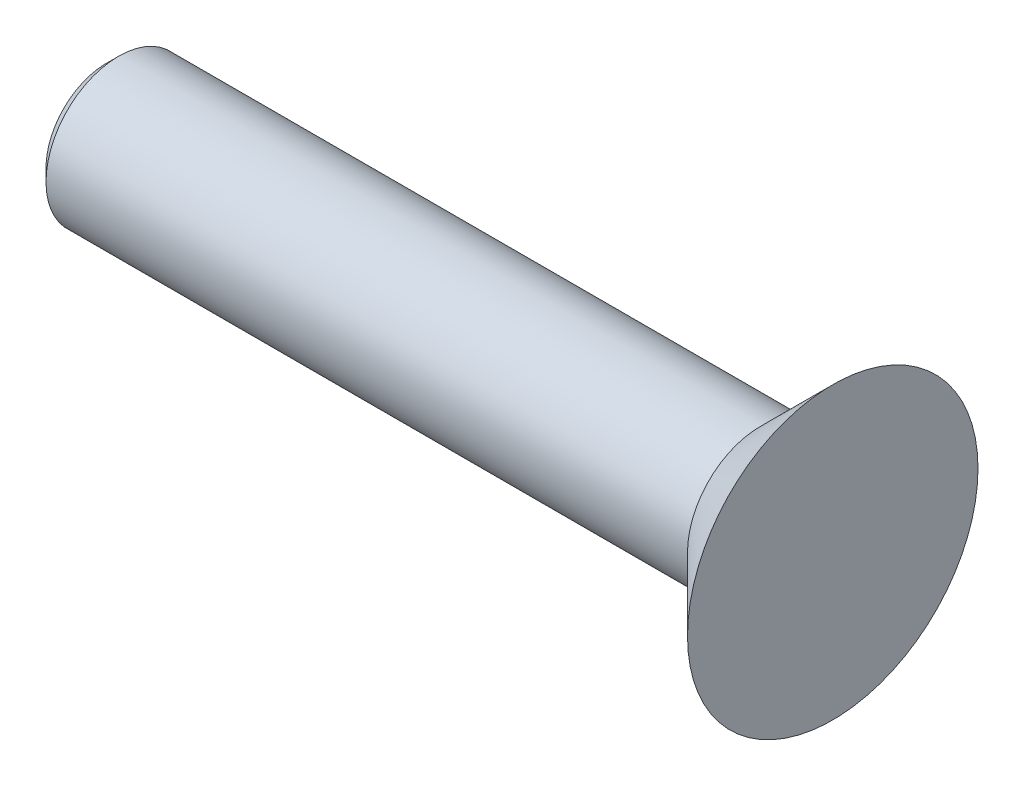
ISO-10303-21;
HEADER;
FILE_DESCRIPTION(('STEP AP214'),'2;1');
FILE_NAME('part.step','',(''),(''),'','','');
FILE_SCHEMA(('AUTOMOTIVE_DESIGN { 1 0 10303 214 1 1 1 1 }'));
ENDSEC;
DATA;
#1=APPLICATION_CONTEXT('core data for automotive mechanical design processes');
#2=APPLICATION_PROTOCOL_DEFINITION('international standard','automotive_design',2000,#1);
#3=PRODUCT_CONTEXT('',#1,'mechanical');
#4=PRODUCT('Part','Part','',(#3));
#5=PRODUCT_RELATED_PRODUCT_CATEGORY('part','',(#4));
#6=PRODUCT_DEFINITION_FORMATION('','',#4);
#7=PRODUCT_DEFINITION_CONTEXT('part definition',#1,'design');
#8=PRODUCT_DEFINITION('design','',#6,#7);
#9=PRODUCT_DEFINITION_SHAPE('','',#8);
#10=(LENGTH_UNIT() NAMED_UNIT(*) SI_UNIT(.MILLI.,.METRE.));
#11=(NAMED_UNIT(*) PLANE_ANGLE_UNIT() SI_UNIT($,.RADIAN.));
#12=(NAMED_UNIT(*) SI_UNIT($,.STERADIAN.) SOLID_ANGLE_UNIT());
#13=UNCERTAINTY_MEASURE_WITH_UNIT(LENGTH_MEASURE(1.E-05),#10,'distance_accuracy_value','');
#14=(GEOMETRIC_REPRESENTATION_CONTEXT(3) GLOBAL_UNCERTAINTY_ASSIGNED_CONTEXT((#13)) GLOBAL_UNIT_ASSIGNED_CONTEXT((#10,
#11,#12)) REPRESENTATION_CONTEXT('',''));
#15=CARTESIAN_POINT('',(0.,0.,0.));
#16=DIRECTION('',(0.,0.,1.));
#17=DIRECTION('',(1.,0.,0.));
#18=AXIS2_PLACEMENT_3D('',#15,#16,#17);
#19=CARTESIAN_POINT('',(0.,2.99999999999998,0.));
#20=DIRECTION('',(-1.,0.,0.));
#21=DIRECTION('',(0.,0.,1.));
#22=AXIS2_PLACEMENT_3D('',#19,#20,#21);
#23=PLANE('',#22);
#24=CARTESIAN_POINT('',(0.,0.,0.));
#25=DIRECTION('',(-1.,0.,0.));
#26=DIRECTION('',(0.,0.,1.));
#27=AXIS2_PLACEMENT_3D('',#24,#25,#26);
#28=CIRCLE('',#27,2.99999999999998);
#29=CARTESIAN_POINT('',(0.,0.,2.99999999999998));
#30=VERTEX_POINT('',#29);
#31=EDGE_CURVE('E34',#30,#30,#28,.T.);
#32=ORIENTED_EDGE('',*,*,#31,.F.);
#33=EDGE_LOOP('',(#32));
#34=FACE_BOUND('',#33,.T.);
#35=ADVANCED_FACE('F24',(#34),#23,.F.);
#36=CARTESIAN_POINT('',(0.,0.,0.));
#37=DIRECTION('',(1.,0.,0.));
#38=DIRECTION('',(0.,0.,-1.));
#39=AXIS2_PLACEMENT_3D('',#36,#37,#38);
#40=CONICAL_SURFACE('',#39,2.99999999999998,0.785398163397443);
#41=CARTESIAN_POINT('',(-1.5,0.,0.));
#42=DIRECTION('',(-1.,0.,0.));
#43=DIRECTION('',(0.,0.,1.));
#44=AXIS2_PLACEMENT_3D('',#41,#42,#43);
#45=CIRCLE('',#44,1.5);
#46=CARTESIAN_POINT('',(-1.5,0.,1.5));
#47=VERTEX_POINT('',#46);
#48=EDGE_CURVE('E38',#47,#47,#45,.T.);
#49=ORIENTED_EDGE('',*,*,#48,.F.);
#50=EDGE_LOOP('',(#49));
#51=FACE_BOUND('',#50,.T.);
#52=ORIENTED_EDGE('',*,*,#31,.T.);
#53=EDGE_LOOP('',(#52));
#54=FACE_BOUND('',#53,.T.);
#55=ADVANCED_FACE('F46',(#51,#54),#40,.T.);
#56=CARTESIAN_POINT('',(0.,0.,0.));
#57=DIRECTION('',(-1.,0.,0.));
#58=DIRECTION('',(0.,0.,1.));
#59=AXIS2_PLACEMENT_3D('',#56,#57,#58);
#60=CYLINDRICAL_SURFACE('',#59,1.5);
#61=CARTESIAN_POINT('',(-14.75,0.,0.));
#62=DIRECTION('',(1.,0.,0.));
#63=DIRECTION('',(0.,0.,-1.));
#64=AXIS2_PLACEMENT_3D('',#61,#62,#63);
#65=CIRCLE('',#64,1.5);
#66=CARTESIAN_POINT('',(-14.75,0.,-1.5));
#67=VERTEX_POINT('',#66);
#68=EDGE_CURVE('E10',#67,#67,#65,.T.);
#69=ORIENTED_EDGE('',*,*,#68,.T.);
#70=EDGE_LOOP('',(#69));
#71=FACE_BOUND('',#70,.T.);
#72=ORIENTED_EDGE('',*,*,#48,.T.);
#73=EDGE_LOOP('',(#72));
#74=FACE_BOUND('',#73,.T.);
#75=ADVANCED_FACE('F44',(#71,#74),#60,.T.);
#76=CARTESIAN_POINT('',(-15.,0.,0.));
#77=DIRECTION('',(1.,0.,0.));
#78=DIRECTION('',(0.,0.,-1.));
#79=AXIS2_PLACEMENT_3D('',#76,#77,#78);
#80=PLANE('',#79);
#81=CARTESIAN_POINT('',(-15.,0.,0.));
#82=DIRECTION('',(1.,0.,0.));
#83=DIRECTION('',(0.,0.,-1.));
#84=AXIS2_PLACEMENT_3D('',#81,#82,#83);
#85=CIRCLE('',#84,1.25);
#86=CARTESIAN_POINT('',(-15.,0.,-1.25));
#87=VERTEX_POINT('',#86);
#88=EDGE_CURVE('E30',#87,#87,#85,.F.);
#89=ORIENTED_EDGE('',*,*,#88,.T.);
#90=EDGE_LOOP('',(#89));
#91=FACE_BOUND('',#90,.T.);
#92=ADVANCED_FACE('F64',(#91),#80,.F.);
#93=CARTESIAN_POINT('',(-15.,0.,0.));
#94=DIRECTION('',(1.,0.,0.));
#95=DIRECTION('',(0.,0.,-1.));
#96=AXIS2_PLACEMENT_3D('',#93,#94,#95);
#97=CONICAL_SURFACE('',#96,1.25,0.785398163397446);
#98=ORIENTED_EDGE('',*,*,#68,.F.);
#99=EDGE_LOOP('',(#98));
#100=FACE_BOUND('',#99,.T.);
#101=ORIENTED_EDGE('',*,*,#88,.F.);
#102=EDGE_LOOP('',(#101));
#103=FACE_BOUND('',#102,.T.);
#104=ADVANCED_FACE('F71',(#100,#103),#97,.T.);
#105=CLOSED_SHELL('',(#35,#55,#75,#92,#104));
#106=MANIFOLD_SOLID_BREP('B2',#105);
#107=ADVANCED_BREP_SHAPE_REPRESENTATION('',(#18,#106),#14);
#108=SHAPE_DEFINITION_REPRESENTATION(#9,#107);
ENDSEC;
END-ISO-10303-21;
